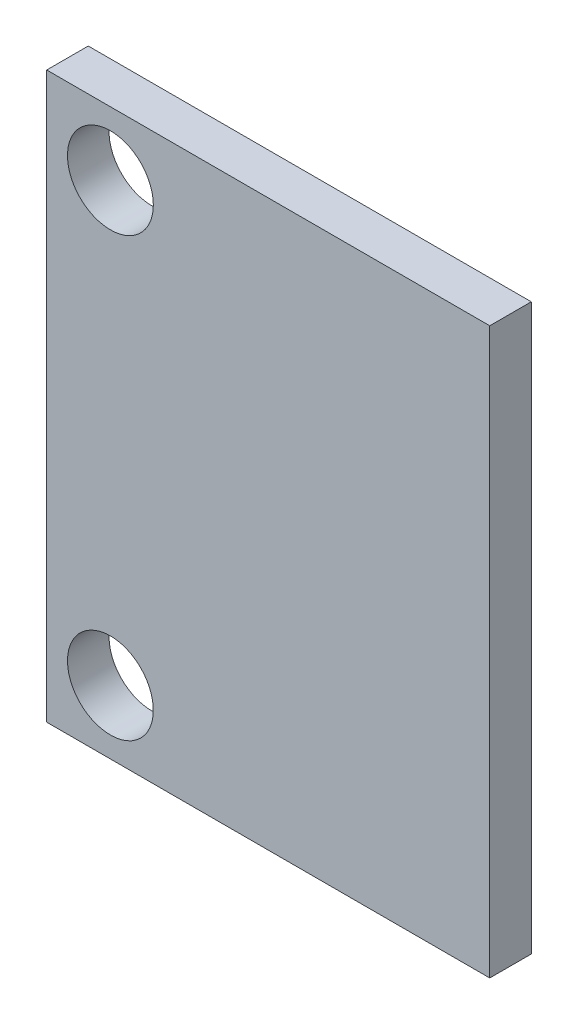
ISO-10303-21;
HEADER;
FILE_DESCRIPTION(('STEP AP214'),'2;1');
FILE_NAME('part.step','',(''),(''),'','','');
FILE_SCHEMA(('AUTOMOTIVE_DESIGN { 1 0 10303 214 1 1 1 1 }'));
ENDSEC;
DATA;
#1=APPLICATION_CONTEXT('core data for automotive mechanical design processes');
#2=APPLICATION_PROTOCOL_DEFINITION('international standard','automotive_design',2000,#1);
#3=PRODUCT_CONTEXT('',#1,'mechanical');
#4=PRODUCT('Part','Part','',(#3));
#5=PRODUCT_RELATED_PRODUCT_CATEGORY('part','',(#4));
#6=PRODUCT_DEFINITION_FORMATION('','',#4);
#7=PRODUCT_DEFINITION_CONTEXT('part definition',#1,'design');
#8=PRODUCT_DEFINITION('design','',#6,#7);
#9=PRODUCT_DEFINITION_SHAPE('','',#8);
#10=(LENGTH_UNIT() NAMED_UNIT(*) SI_UNIT(.MILLI.,.METRE.));
#11=(NAMED_UNIT(*) PLANE_ANGLE_UNIT() SI_UNIT($,.RADIAN.));
#12=(NAMED_UNIT(*) SI_UNIT($,.STERADIAN.) SOLID_ANGLE_UNIT());
#13=UNCERTAINTY_MEASURE_WITH_UNIT(LENGTH_MEASURE(1.E-05),#10,'distance_accuracy_value','');
#14=(GEOMETRIC_REPRESENTATION_CONTEXT(3) GLOBAL_UNCERTAINTY_ASSIGNED_CONTEXT((#13)) GLOBAL_UNIT_ASSIGNED_CONTEXT((#10,
#11,#12)) REPRESENTATION_CONTEXT('',''));
#15=CARTESIAN_POINT('',(0.,0.,0.));
#16=DIRECTION('',(0.,0.,1.));
#17=DIRECTION('',(1.,0.,0.));
#18=AXIS2_PLACEMENT_3D('',#15,#16,#17);
#19=CARTESIAN_POINT('',(0.,0.,1.5));
#20=DIRECTION('',(0.,0.,1.));
#21=DIRECTION('',(1.,0.,0.));
#22=AXIS2_PLACEMENT_3D('',#19,#20,#21);
#23=PLANE('',#22);
#24=CARTESIAN_POINT('',(-5.7,7.9,1.5));
#25=DIRECTION('',(0.,0.,1.));
#26=DIRECTION('',(1.,0.,0.));
#27=AXIS2_PLACEMENT_3D('',#24,#25,#26);
#28=CIRCLE('',#27,1.55);
#29=CARTESIAN_POINT('',(-4.15,7.9,1.5));
#30=VERTEX_POINT('',#29);
#31=EDGE_CURVE('E100',#30,#30,#28,.T.);
#32=ORIENTED_EDGE('',*,*,#31,.F.);
#33=EDGE_LOOP('',(#32));
#34=FACE_BOUND('',#33,.T.);
#35=DIRECTION('',(0.,-1.,0.));
#36=VECTOR('',#35,1.);
#37=CARTESIAN_POINT('',(-8.,-10.2,1.5));
#38=LINE('',#37,#36);
#39=CARTESIAN_POINT('',(-8.,10.2,1.5));
#40=VERTEX_POINT('',#39);
#41=CARTESIAN_POINT('',(-8.,-10.2,1.5));
#42=VERTEX_POINT('',#41);
#43=EDGE_CURVE('E85',#40,#42,#38,.T.);
#44=ORIENTED_EDGE('',*,*,#43,.T.);
#45=DIRECTION('',(1.,0.,0.));
#46=VECTOR('',#45,1.);
#47=CARTESIAN_POINT('',(8.,-10.2,1.5));
#48=LINE('',#47,#46);
#49=CARTESIAN_POINT('',(8.,-10.2,1.5));
#50=VERTEX_POINT('',#49);
#51=EDGE_CURVE('E80',#42,#50,#48,.T.);
#52=ORIENTED_EDGE('',*,*,#51,.T.);
#53=DIRECTION('',(0.,1.,0.));
#54=VECTOR('',#53,1.);
#55=CARTESIAN_POINT('',(8.,-10.2,1.5));
#56=LINE('',#55,#54);
#57=CARTESIAN_POINT('',(8.,10.2,1.5));
#58=VERTEX_POINT('',#57);
#59=EDGE_CURVE('E83',#50,#58,#56,.T.);
#60=ORIENTED_EDGE('',*,*,#59,.T.);
#61=DIRECTION('',(-1.,0.,0.));
#62=VECTOR('',#61,1.);
#63=CARTESIAN_POINT('',(8.,10.2,1.5));
#64=LINE('',#63,#62);
#65=EDGE_CURVE('E50',#58,#40,#64,.T.);
#66=ORIENTED_EDGE('',*,*,#65,.T.);
#67=EDGE_LOOP('',(#44,#52,#60,#66));
#68=FACE_BOUND('',#67,.T.);
#69=CARTESIAN_POINT('',(-5.69999999999999,-7.9,1.5));
#70=DIRECTION('',(0.,0.,1.));
#71=DIRECTION('',(-1.,0.,0.));
#72=AXIS2_PLACEMENT_3D('',#69,#70,#71);
#73=CIRCLE('',#72,1.55);
#74=CARTESIAN_POINT('',(-7.24999999999999,-7.9,1.5));
#75=VERTEX_POINT('',#74);
#76=EDGE_CURVE('E115',#75,#75,#73,.T.);
#77=ORIENTED_EDGE('',*,*,#76,.F.);
#78=EDGE_LOOP('',(#77));
#79=FACE_BOUND('',#78,.T.);
#80=ADVANCED_FACE('F33',(#34,#68,#79),#23,.T.);
#81=CARTESIAN_POINT('',(0.,0.,0.));
#82=DIRECTION('',(0.,0.,1.));
#83=DIRECTION('',(1.,0.,0.));
#84=AXIS2_PLACEMENT_3D('',#81,#82,#83);
#85=PLANE('',#84);
#86=DIRECTION('',(0.,-1.,0.));
#87=VECTOR('',#86,1.);
#88=CARTESIAN_POINT('',(-8.,-10.2,0.));
#89=LINE('',#88,#87);
#90=CARTESIAN_POINT('',(-8.,10.2,0.));
#91=VERTEX_POINT('',#90);
#92=CARTESIAN_POINT('',(-8.,-10.2,0.));
#93=VERTEX_POINT('',#92);
#94=EDGE_CURVE('E97',#91,#93,#89,.T.);
#95=ORIENTED_EDGE('',*,*,#94,.F.);
#96=DIRECTION('',(-1.,0.,0.));
#97=VECTOR('',#96,1.);
#98=CARTESIAN_POINT('',(8.,10.2,0.));
#99=LINE('',#98,#97);
#100=CARTESIAN_POINT('',(8.,10.2,0.));
#101=VERTEX_POINT('',#100);
#102=EDGE_CURVE('E73',#101,#91,#99,.T.);
#103=ORIENTED_EDGE('',*,*,#102,.F.);
#104=DIRECTION('',(0.,1.,0.));
#105=VECTOR('',#104,1.);
#106=CARTESIAN_POINT('',(8.,-10.2,0.));
#107=LINE('',#106,#105);
#108=CARTESIAN_POINT('',(8.,-10.2,0.));
#109=VERTEX_POINT('',#108);
#110=EDGE_CURVE('E67',#109,#101,#107,.T.);
#111=ORIENTED_EDGE('',*,*,#110,.F.);
#112=DIRECTION('',(1.,0.,0.));
#113=VECTOR('',#112,1.);
#114=CARTESIAN_POINT('',(8.,-10.2,0.));
#115=LINE('',#114,#113);
#116=EDGE_CURVE('E89',#93,#109,#115,.T.);
#117=ORIENTED_EDGE('',*,*,#116,.F.);
#118=EDGE_LOOP('',(#95,#103,#111,#117));
#119=FACE_BOUND('',#118,.T.);
#120=CARTESIAN_POINT('',(-5.7,7.9,0.));
#121=DIRECTION('',(0.,0.,1.));
#122=DIRECTION('',(1.,0.,0.));
#123=AXIS2_PLACEMENT_3D('',#120,#121,#122);
#124=CIRCLE('',#123,1.55);
#125=CARTESIAN_POINT('',(-4.15,7.9,0.));
#126=VERTEX_POINT('',#125);
#127=EDGE_CURVE('E112',#126,#126,#124,.T.);
#128=ORIENTED_EDGE('',*,*,#127,.T.);
#129=EDGE_LOOP('',(#128));
#130=FACE_BOUND('',#129,.T.);
#131=CARTESIAN_POINT('',(-5.69999999999999,-7.9,0.));
#132=DIRECTION('',(0.,0.,1.));
#133=DIRECTION('',(-1.,0.,0.));
#134=AXIS2_PLACEMENT_3D('',#131,#132,#133);
#135=CIRCLE('',#134,1.55);
#136=CARTESIAN_POINT('',(-7.24999999999999,-7.9,0.));
#137=VERTEX_POINT('',#136);
#138=EDGE_CURVE('E118',#137,#137,#135,.T.);
#139=ORIENTED_EDGE('',*,*,#138,.T.);
#140=EDGE_LOOP('',(#139));
#141=FACE_BOUND('',#140,.T.);
#142=ADVANCED_FACE('F108',(#119,#130,#141),#85,.F.);
#143=CARTESIAN_POINT('',(-8.,-10.2,1.5));
#144=DIRECTION('',(1.,0.,0.));
#145=DIRECTION('',(0.,0.,-1.));
#146=AXIS2_PLACEMENT_3D('',#143,#144,#145);
#147=PLANE('',#146);
#148=ORIENTED_EDGE('',*,*,#94,.T.);
#149=DIRECTION('',(0.,0.,-1.));
#150=VECTOR('',#149,1.);
#151=CARTESIAN_POINT('',(-8.,-10.2,1.5));
#152=LINE('',#151,#150);
#153=EDGE_CURVE('E11',#42,#93,#152,.T.);
#154=ORIENTED_EDGE('',*,*,#153,.F.);
#155=ORIENTED_EDGE('',*,*,#43,.F.);
#156=DIRECTION('',(0.,0.,-1.));
#157=VECTOR('',#156,1.);
#158=CARTESIAN_POINT('',(-8.,10.2,1.5));
#159=LINE('',#158,#157);
#160=EDGE_CURVE('E93',#40,#91,#159,.T.);
#161=ORIENTED_EDGE('',*,*,#160,.T.);
#162=EDGE_LOOP('',(#148,#154,#155,#161));
#163=FACE_BOUND('',#162,.T.);
#164=ADVANCED_FACE('F35',(#163),#147,.F.);
#165=CARTESIAN_POINT('',(8.,-10.2,1.5));
#166=DIRECTION('',(0.,1.,0.));
#167=DIRECTION('',(-1.,0.,0.));
#168=AXIS2_PLACEMENT_3D('',#165,#166,#167);
#169=PLANE('',#168);
#170=ORIENTED_EDGE('',*,*,#116,.T.);
#171=DIRECTION('',(0.,0.,-1.));
#172=VECTOR('',#171,1.);
#173=CARTESIAN_POINT('',(8.,-10.2,1.5));
#174=LINE('',#173,#172);
#175=EDGE_CURVE('E42',#50,#109,#174,.T.);
#176=ORIENTED_EDGE('',*,*,#175,.F.);
#177=ORIENTED_EDGE('',*,*,#51,.F.);
#178=ORIENTED_EDGE('',*,*,#153,.T.);
#179=EDGE_LOOP('',(#170,#176,#177,#178));
#180=FACE_BOUND('',#179,.T.);
#181=ADVANCED_FACE('F88',(#180),#169,.F.);
#182=CARTESIAN_POINT('',(8.,-10.2,1.5));
#183=DIRECTION('',(-1.,0.,0.));
#184=DIRECTION('',(0.,0.,1.));
#185=AXIS2_PLACEMENT_3D('',#182,#183,#184);
#186=PLANE('',#185);
#187=ORIENTED_EDGE('',*,*,#110,.T.);
#188=DIRECTION('',(0.,0.,-1.));
#189=VECTOR('',#188,1.);
#190=CARTESIAN_POINT('',(8.,10.2,1.5));
#191=LINE('',#190,#189);
#192=EDGE_CURVE('E90',#58,#101,#191,.T.);
#193=ORIENTED_EDGE('',*,*,#192,.F.);
#194=ORIENTED_EDGE('',*,*,#59,.F.);
#195=ORIENTED_EDGE('',*,*,#175,.T.);
#196=EDGE_LOOP('',(#187,#193,#194,#195));
#197=FACE_BOUND('',#196,.T.);
#198=ADVANCED_FACE('F91',(#197),#186,.F.);
#199=CARTESIAN_POINT('',(8.,10.2,1.5));
#200=DIRECTION('',(0.,-1.,0.));
#201=DIRECTION('',(1.,0.,0.));
#202=AXIS2_PLACEMENT_3D('',#199,#200,#201);
#203=PLANE('',#202);
#204=ORIENTED_EDGE('',*,*,#102,.T.);
#205=ORIENTED_EDGE('',*,*,#160,.F.);
#206=ORIENTED_EDGE('',*,*,#65,.F.);
#207=ORIENTED_EDGE('',*,*,#192,.T.);
#208=EDGE_LOOP('',(#204,#205,#206,#207));
#209=FACE_BOUND('',#208,.T.);
#210=ADVANCED_FACE('F105',(#209),#203,.F.);
#211=CARTESIAN_POINT('',(-5.7,7.9,1.5));
#212=DIRECTION('',(0.,0.,-1.));
#213=DIRECTION('',(-1.,0.,0.));
#214=AXIS2_PLACEMENT_3D('',#211,#212,#213);
#215=CYLINDRICAL_SURFACE('',#214,1.55);
#216=ORIENTED_EDGE('',*,*,#31,.T.);
#217=EDGE_LOOP('',(#216));
#218=FACE_BOUND('',#217,.T.);
#219=ORIENTED_EDGE('',*,*,#127,.F.);
#220=EDGE_LOOP('',(#219));
#221=FACE_BOUND('',#220,.T.);
#222=ADVANCED_FACE('F135',(#218,#221),#215,.F.);
#223=CARTESIAN_POINT('',(-5.69999999999999,-7.9,1.5));
#224=DIRECTION('',(0.,0.,-1.));
#225=DIRECTION('',(-1.,0.,0.));
#226=AXIS2_PLACEMENT_3D('',#223,#224,#225);
#227=CYLINDRICAL_SURFACE('',#226,1.55);
#228=ORIENTED_EDGE('',*,*,#76,.T.);
#229=EDGE_LOOP('',(#228));
#230=FACE_BOUND('',#229,.T.);
#231=ORIENTED_EDGE('',*,*,#138,.F.);
#232=EDGE_LOOP('',(#231));
#233=FACE_BOUND('',#232,.T.);
#234=ADVANCED_FACE('F124',(#230,#233),#227,.F.);
#235=CLOSED_SHELL('',(#80,#142,#164,#181,#198,#210,#222,#234));
#236=MANIFOLD_SOLID_BREP('B2',#235);
#237=ADVANCED_BREP_SHAPE_REPRESENTATION('',(#18,#236),#14);
#238=SHAPE_DEFINITION_REPRESENTATION(#9,#237);
ENDSEC;
END-ISO-10303-21;
